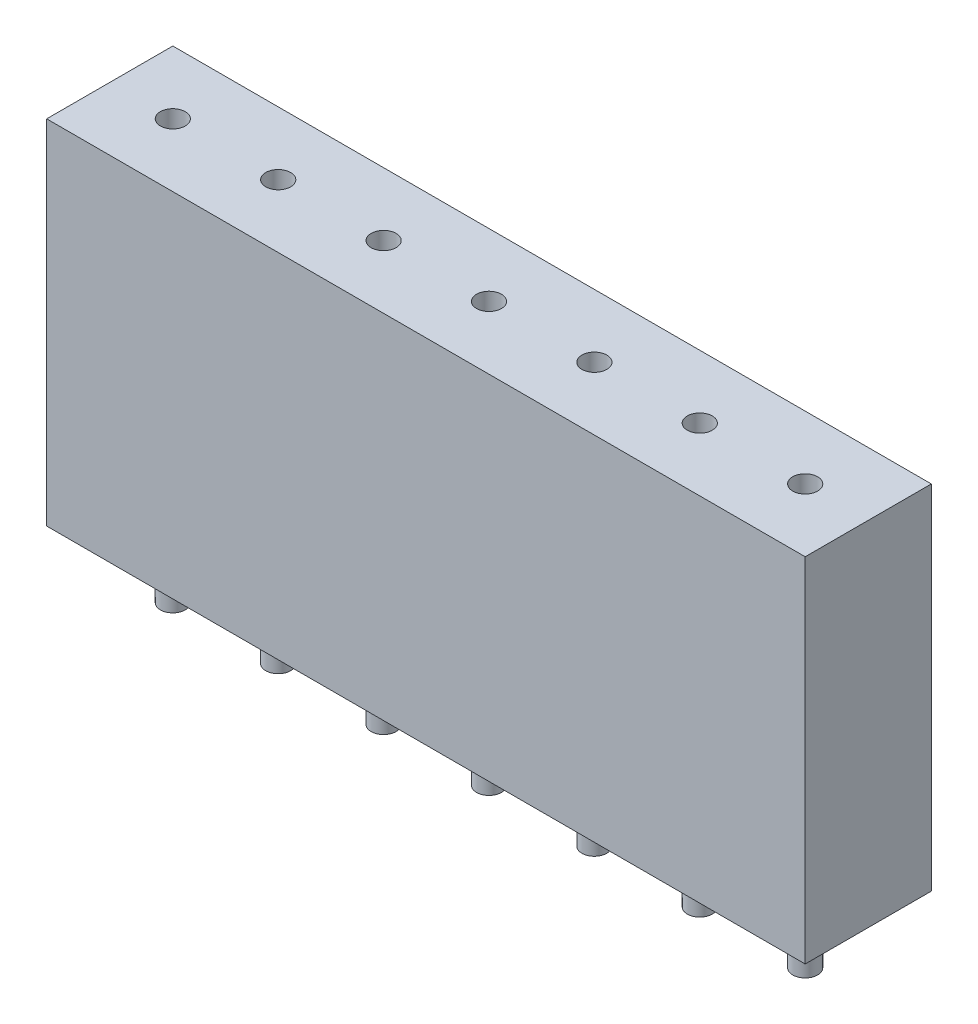
ISO-10303-21;
HEADER;
FILE_DESCRIPTION(('STEP AP214'),'2;1');
FILE_NAME('part.step','',(''),(''),'','','');
FILE_SCHEMA(('AUTOMOTIVE_DESIGN { 1 0 10303 214 1 1 1 1 }'));
ENDSEC;
DATA;
#1=APPLICATION_CONTEXT('core data for automotive mechanical design processes');
#2=APPLICATION_PROTOCOL_DEFINITION('international standard','automotive_design',2000,#1);
#3=PRODUCT_CONTEXT('',#1,'mechanical');
#4=PRODUCT('Part','Part','',(#3));
#5=PRODUCT_RELATED_PRODUCT_CATEGORY('part','',(#4));
#6=PRODUCT_DEFINITION_FORMATION('','',#4);
#7=PRODUCT_DEFINITION_CONTEXT('part definition',#1,'design');
#8=PRODUCT_DEFINITION('design','',#6,#7);
#9=PRODUCT_DEFINITION_SHAPE('','',#8);
#10=(LENGTH_UNIT() NAMED_UNIT(*) SI_UNIT(.MILLI.,.METRE.));
#11=(NAMED_UNIT(*) PLANE_ANGLE_UNIT() SI_UNIT($,.RADIAN.));
#12=(NAMED_UNIT(*) SI_UNIT($,.STERADIAN.) SOLID_ANGLE_UNIT());
#13=UNCERTAINTY_MEASURE_WITH_UNIT(LENGTH_MEASURE(1.E-05),#10,'distance_accuracy_value','');
#14=(GEOMETRIC_REPRESENTATION_CONTEXT(3) GLOBAL_UNCERTAINTY_ASSIGNED_CONTEXT((#13)) GLOBAL_UNIT_ASSIGNED_CONTEXT((#10,
#11,#12)) REPRESENTATION_CONTEXT('',''));
#15=CARTESIAN_POINT('',(0.,0.,0.));
#16=DIRECTION('',(0.,0.,1.));
#17=DIRECTION('',(1.,0.,0.));
#18=AXIS2_PLACEMENT_3D('',#15,#16,#17);
#19=CARTESIAN_POINT('',(7.61999999999998,-1.6,0.));
#20=DIRECTION('',(0.,1.,0.));
#21=DIRECTION('',(0.,0.,1.));
#22=AXIS2_PLACEMENT_3D('',#19,#20,#21);
#23=CYLINDRICAL_SURFACE('',#22,0.3);
#24=CARTESIAN_POINT('',(7.61999999999998,-1.6,0.));
#25=DIRECTION('',(0.,-1.,0.));
#26=DIRECTION('',(0.,0.,-1.));
#27=AXIS2_PLACEMENT_3D('',#24,#25,#26);
#28=CIRCLE('',#27,0.3);
#29=CARTESIAN_POINT('',(7.61999999999998,-1.6,-0.3));
#30=VERTEX_POINT('',#29);
#31=EDGE_CURVE('E11',#30,#30,#28,.T.);
#32=ORIENTED_EDGE('',*,*,#31,.F.);
#33=EDGE_LOOP('',(#32));
#34=FACE_BOUND('',#33,.T.);
#35=CARTESIAN_POINT('',(7.61999999999998,0.,0.));
#36=DIRECTION('',(0.,-1.,0.));
#37=DIRECTION('',(0.,0.,-1.));
#38=AXIS2_PLACEMENT_3D('',#35,#36,#37);
#39=CIRCLE('',#38,0.3);
#40=CARTESIAN_POINT('',(7.61999999999998,0.,-0.3));
#41=VERTEX_POINT('',#40);
#42=EDGE_CURVE('E45',#41,#41,#39,.T.);
#43=ORIENTED_EDGE('',*,*,#42,.T.);
#44=EDGE_LOOP('',(#43));
#45=FACE_BOUND('',#44,.T.);
#46=ADVANCED_FACE('F42',(#34,#45),#23,.T.);
#47=CARTESIAN_POINT('',(7.61999999999998,-1.6,0.));
#48=DIRECTION('',(0.,-1.,0.));
#49=DIRECTION('',(0.,0.,-1.));
#50=AXIS2_PLACEMENT_3D('',#47,#48,#49);
#51=PLANE('',#50);
#52=ORIENTED_EDGE('',*,*,#31,.T.);
#53=EDGE_LOOP('',(#52));
#54=FACE_BOUND('',#53,.T.);
#55=ADVANCED_FACE('F57',(#54),#51,.T.);
#56=CARTESIAN_POINT('',(7.61999999999998,0.,0.));
#57=DIRECTION('',(0.,-1.,0.));
#58=DIRECTION('',(0.,0.,-1.));
#59=AXIS2_PLACEMENT_3D('',#56,#57,#58);
#60=PLANE('',#59);
#61=ORIENTED_EDGE('',*,*,#42,.F.);
#62=EDGE_LOOP('',(#61));
#63=FACE_BOUND('',#62,.T.);
#64=ADVANCED_FACE('F55',(#63),#60,.F.);
#65=CLOSED_SHELL('',(#46,#55,#64));
#66=MANIFOLD_SOLID_BREP('B2',#65);
#67=CARTESIAN_POINT('',(5.07999999999998,-1.6,0.));
#68=DIRECTION('',(0.,1.,0.));
#69=DIRECTION('',(0.,0.,1.));
#70=AXIS2_PLACEMENT_3D('',#67,#68,#69);
#71=CYLINDRICAL_SURFACE('',#70,0.3);
#72=CARTESIAN_POINT('',(5.07999999999998,-1.6,0.));
#73=DIRECTION('',(0.,-1.,0.));
#74=DIRECTION('',(0.,0.,-1.));
#75=AXIS2_PLACEMENT_3D('',#72,#73,#74);
#76=CIRCLE('',#75,0.3);
#77=CARTESIAN_POINT('',(5.07999999999998,-1.6,-0.3));
#78=VERTEX_POINT('',#77);
#79=EDGE_CURVE('E41',#78,#78,#76,.T.);
#80=ORIENTED_EDGE('',*,*,#79,.F.);
#81=EDGE_LOOP('',(#80));
#82=FACE_BOUND('',#81,.T.);
#83=CARTESIAN_POINT('',(5.07999999999998,0.,0.));
#84=DIRECTION('',(0.,-1.,0.));
#85=DIRECTION('',(0.,0.,-1.));
#86=AXIS2_PLACEMENT_3D('',#83,#84,#85);
#87=CIRCLE('',#86,0.3);
#88=CARTESIAN_POINT('',(5.07999999999998,0.,-0.3));
#89=VERTEX_POINT('',#88);
#90=EDGE_CURVE('E94',#89,#89,#87,.T.);
#91=ORIENTED_EDGE('',*,*,#90,.T.);
#92=EDGE_LOOP('',(#91));
#93=FACE_BOUND('',#92,.T.);
#94=ADVANCED_FACE('F91',(#82,#93),#71,.T.);
#95=CARTESIAN_POINT('',(5.07999999999998,-1.6,0.));
#96=DIRECTION('',(0.,-1.,0.));
#97=DIRECTION('',(0.,0.,-1.));
#98=AXIS2_PLACEMENT_3D('',#95,#96,#97);
#99=PLANE('',#98);
#100=ORIENTED_EDGE('',*,*,#79,.T.);
#101=EDGE_LOOP('',(#100));
#102=FACE_BOUND('',#101,.T.);
#103=ADVANCED_FACE('F106',(#102),#99,.T.);
#104=CARTESIAN_POINT('',(5.07999999999998,0.,0.));
#105=DIRECTION('',(0.,-1.,0.));
#106=DIRECTION('',(0.,0.,-1.));
#107=AXIS2_PLACEMENT_3D('',#104,#105,#106);
#108=PLANE('',#107);
#109=ORIENTED_EDGE('',*,*,#90,.F.);
#110=EDGE_LOOP('',(#109));
#111=FACE_BOUND('',#110,.T.);
#112=ADVANCED_FACE('F104',(#111),#108,.F.);
#113=CLOSED_SHELL('',(#94,#103,#112));
#114=MANIFOLD_SOLID_BREP('B6',#113);
#115=CARTESIAN_POINT('',(2.53999999999998,-1.6,0.));
#116=DIRECTION('',(0.,1.,0.));
#117=DIRECTION('',(0.,0.,1.));
#118=AXIS2_PLACEMENT_3D('',#115,#116,#117);
#119=CYLINDRICAL_SURFACE('',#118,0.3);
#120=CARTESIAN_POINT('',(2.53999999999998,-1.6,0.));
#121=DIRECTION('',(0.,-1.,0.));
#122=DIRECTION('',(0.,0.,-1.));
#123=AXIS2_PLACEMENT_3D('',#120,#121,#122);
#124=CIRCLE('',#123,0.3);
#125=CARTESIAN_POINT('',(2.53999999999998,-1.6,-0.3));
#126=VERTEX_POINT('',#125);
#127=EDGE_CURVE('E90',#126,#126,#124,.T.);
#128=ORIENTED_EDGE('',*,*,#127,.F.);
#129=EDGE_LOOP('',(#128));
#130=FACE_BOUND('',#129,.T.);
#131=CARTESIAN_POINT('',(2.53999999999998,0.,0.));
#132=DIRECTION('',(0.,-1.,0.));
#133=DIRECTION('',(0.,0.,-1.));
#134=AXIS2_PLACEMENT_3D('',#131,#132,#133);
#135=CIRCLE('',#134,0.3);
#136=CARTESIAN_POINT('',(2.53999999999998,0.,-0.3));
#137=VERTEX_POINT('',#136);
#138=EDGE_CURVE('E143',#137,#137,#135,.T.);
#139=ORIENTED_EDGE('',*,*,#138,.T.);
#140=EDGE_LOOP('',(#139));
#141=FACE_BOUND('',#140,.T.);
#142=ADVANCED_FACE('F140',(#130,#141),#119,.T.);
#143=CARTESIAN_POINT('',(2.53999999999998,-1.6,0.));
#144=DIRECTION('',(0.,-1.,0.));
#145=DIRECTION('',(0.,0.,-1.));
#146=AXIS2_PLACEMENT_3D('',#143,#144,#145);
#147=PLANE('',#146);
#148=ORIENTED_EDGE('',*,*,#127,.T.);
#149=EDGE_LOOP('',(#148));
#150=FACE_BOUND('',#149,.T.);
#151=ADVANCED_FACE('F155',(#150),#147,.T.);
#152=CARTESIAN_POINT('',(2.53999999999998,0.,0.));
#153=DIRECTION('',(0.,-1.,0.));
#154=DIRECTION('',(0.,0.,-1.));
#155=AXIS2_PLACEMENT_3D('',#152,#153,#154);
#156=PLANE('',#155);
#157=ORIENTED_EDGE('',*,*,#138,.F.);
#158=EDGE_LOOP('',(#157));
#159=FACE_BOUND('',#158,.T.);
#160=ADVANCED_FACE('F153',(#159),#156,.F.);
#161=CLOSED_SHELL('',(#142,#151,#160));
#162=MANIFOLD_SOLID_BREP('B36',#161);
#163=CARTESIAN_POINT('',(0.,-1.6,0.));
#164=DIRECTION('',(0.,1.,0.));
#165=DIRECTION('',(0.,0.,1.));
#166=AXIS2_PLACEMENT_3D('',#163,#164,#165);
#167=CYLINDRICAL_SURFACE('',#166,0.3);
#168=CARTESIAN_POINT('',(0.,-1.6,0.));
#169=DIRECTION('',(0.,-1.,0.));
#170=DIRECTION('',(0.,0.,-1.));
#171=AXIS2_PLACEMENT_3D('',#168,#169,#170);
#172=CIRCLE('',#171,0.3);
#173=CARTESIAN_POINT('',(0.,-1.6,-0.3));
#174=VERTEX_POINT('',#173);
#175=EDGE_CURVE('E139',#174,#174,#172,.T.);
#176=ORIENTED_EDGE('',*,*,#175,.F.);
#177=EDGE_LOOP('',(#176));
#178=FACE_BOUND('',#177,.T.);
#179=CARTESIAN_POINT('',(0.,0.,0.));
#180=DIRECTION('',(0.,-1.,0.));
#181=DIRECTION('',(0.,0.,-1.));
#182=AXIS2_PLACEMENT_3D('',#179,#180,#181);
#183=CIRCLE('',#182,0.3);
#184=CARTESIAN_POINT('',(0.,0.,-0.3));
#185=VERTEX_POINT('',#184);
#186=EDGE_CURVE('E192',#185,#185,#183,.T.);
#187=ORIENTED_EDGE('',*,*,#186,.T.);
#188=EDGE_LOOP('',(#187));
#189=FACE_BOUND('',#188,.T.);
#190=ADVANCED_FACE('F189',(#178,#189),#167,.T.);
#191=CARTESIAN_POINT('',(0.,-1.6,0.));
#192=DIRECTION('',(0.,-1.,0.));
#193=DIRECTION('',(0.,0.,-1.));
#194=AXIS2_PLACEMENT_3D('',#191,#192,#193);
#195=PLANE('',#194);
#196=ORIENTED_EDGE('',*,*,#175,.T.);
#197=EDGE_LOOP('',(#196));
#198=FACE_BOUND('',#197,.T.);
#199=ADVANCED_FACE('F204',(#198),#195,.T.);
#200=CARTESIAN_POINT('',(0.,0.,0.));
#201=DIRECTION('',(0.,-1.,0.));
#202=DIRECTION('',(0.,0.,-1.));
#203=AXIS2_PLACEMENT_3D('',#200,#201,#202);
#204=PLANE('',#203);
#205=ORIENTED_EDGE('',*,*,#186,.F.);
#206=EDGE_LOOP('',(#205));
#207=FACE_BOUND('',#206,.T.);
#208=ADVANCED_FACE('F202',(#207),#204,.F.);
#209=CLOSED_SHELL('',(#190,#199,#208));
#210=MANIFOLD_SOLID_BREP('B85',#209);
#211=CARTESIAN_POINT('',(-2.54000000000002,-1.6,0.));
#212=DIRECTION('',(0.,1.,0.));
#213=DIRECTION('',(0.,0.,1.));
#214=AXIS2_PLACEMENT_3D('',#211,#212,#213);
#215=CYLINDRICAL_SURFACE('',#214,0.3);
#216=CARTESIAN_POINT('',(-2.54000000000002,-1.6,0.));
#217=DIRECTION('',(0.,-1.,0.));
#218=DIRECTION('',(0.,0.,-1.));
#219=AXIS2_PLACEMENT_3D('',#216,#217,#218);
#220=CIRCLE('',#219,0.3);
#221=CARTESIAN_POINT('',(-2.54000000000002,-1.6,-0.3));
#222=VERTEX_POINT('',#221);
#223=EDGE_CURVE('E188',#222,#222,#220,.T.);
#224=ORIENTED_EDGE('',*,*,#223,.F.);
#225=EDGE_LOOP('',(#224));
#226=FACE_BOUND('',#225,.T.);
#227=CARTESIAN_POINT('',(-2.54000000000002,0.,0.));
#228=DIRECTION('',(0.,-1.,0.));
#229=DIRECTION('',(0.,0.,-1.));
#230=AXIS2_PLACEMENT_3D('',#227,#228,#229);
#231=CIRCLE('',#230,0.3);
#232=CARTESIAN_POINT('',(-2.54000000000002,0.,-0.3));
#233=VERTEX_POINT('',#232);
#234=EDGE_CURVE('E241',#233,#233,#231,.T.);
#235=ORIENTED_EDGE('',*,*,#234,.T.);
#236=EDGE_LOOP('',(#235));
#237=FACE_BOUND('',#236,.T.);
#238=ADVANCED_FACE('F238',(#226,#237),#215,.T.);
#239=CARTESIAN_POINT('',(-2.54000000000002,-1.6,0.));
#240=DIRECTION('',(0.,-1.,0.));
#241=DIRECTION('',(0.,0.,-1.));
#242=AXIS2_PLACEMENT_3D('',#239,#240,#241);
#243=PLANE('',#242);
#244=ORIENTED_EDGE('',*,*,#223,.T.);
#245=EDGE_LOOP('',(#244));
#246=FACE_BOUND('',#245,.T.);
#247=ADVANCED_FACE('F253',(#246),#243,.T.);
#248=CARTESIAN_POINT('',(-2.54000000000002,0.,0.));
#249=DIRECTION('',(0.,-1.,0.));
#250=DIRECTION('',(0.,0.,-1.));
#251=AXIS2_PLACEMENT_3D('',#248,#249,#250);
#252=PLANE('',#251);
#253=ORIENTED_EDGE('',*,*,#234,.F.);
#254=EDGE_LOOP('',(#253));
#255=FACE_BOUND('',#254,.T.);
#256=ADVANCED_FACE('F251',(#255),#252,.F.);
#257=CLOSED_SHELL('',(#238,#247,#256));
#258=MANIFOLD_SOLID_BREP('B134',#257);
#259=CARTESIAN_POINT('',(-7.62000000000002,-1.6,0.));
#260=DIRECTION('',(0.,1.,0.));
#261=DIRECTION('',(0.,0.,1.));
#262=AXIS2_PLACEMENT_3D('',#259,#260,#261);
#263=CYLINDRICAL_SURFACE('',#262,0.3);
#264=CARTESIAN_POINT('',(-7.62000000000002,-1.6,0.));
#265=DIRECTION('',(0.,-1.,0.));
#266=DIRECTION('',(0.,0.,-1.));
#267=AXIS2_PLACEMENT_3D('',#264,#265,#266);
#268=CIRCLE('',#267,0.3);
#269=CARTESIAN_POINT('',(-7.62000000000002,-1.6,-0.3));
#270=VERTEX_POINT('',#269);
#271=EDGE_CURVE('E237',#270,#270,#268,.T.);
#272=ORIENTED_EDGE('',*,*,#271,.F.);
#273=EDGE_LOOP('',(#272));
#274=FACE_BOUND('',#273,.T.);
#275=CARTESIAN_POINT('',(-7.62000000000002,0.,0.));
#276=DIRECTION('',(0.,-1.,0.));
#277=DIRECTION('',(0.,0.,-1.));
#278=AXIS2_PLACEMENT_3D('',#275,#276,#277);
#279=CIRCLE('',#278,0.3);
#280=CARTESIAN_POINT('',(-7.62000000000002,0.,-0.3));
#281=VERTEX_POINT('',#280);
#282=EDGE_CURVE('E290',#281,#281,#279,.T.);
#283=ORIENTED_EDGE('',*,*,#282,.T.);
#284=EDGE_LOOP('',(#283));
#285=FACE_BOUND('',#284,.T.);
#286=ADVANCED_FACE('F287',(#274,#285),#263,.T.);
#287=CARTESIAN_POINT('',(-7.62000000000002,-1.6,0.));
#288=DIRECTION('',(0.,-1.,0.));
#289=DIRECTION('',(0.,0.,-1.));
#290=AXIS2_PLACEMENT_3D('',#287,#288,#289);
#291=PLANE('',#290);
#292=ORIENTED_EDGE('',*,*,#271,.T.);
#293=EDGE_LOOP('',(#292));
#294=FACE_BOUND('',#293,.T.);
#295=ADVANCED_FACE('F302',(#294),#291,.T.);
#296=CARTESIAN_POINT('',(-7.62000000000002,0.,0.));
#297=DIRECTION('',(0.,-1.,0.));
#298=DIRECTION('',(0.,0.,-1.));
#299=AXIS2_PLACEMENT_3D('',#296,#297,#298);
#300=PLANE('',#299);
#301=ORIENTED_EDGE('',*,*,#282,.F.);
#302=EDGE_LOOP('',(#301));
#303=FACE_BOUND('',#302,.T.);
#304=ADVANCED_FACE('F300',(#303),#300,.F.);
#305=CLOSED_SHELL('',(#286,#295,#304));
#306=MANIFOLD_SOLID_BREP('B183',#305);
#307=CARTESIAN_POINT('',(-5.08000000000002,-1.6,0.));
#308=DIRECTION('',(0.,1.,0.));
#309=DIRECTION('',(0.,0.,1.));
#310=AXIS2_PLACEMENT_3D('',#307,#308,#309);
#311=CYLINDRICAL_SURFACE('',#310,0.3);
#312=CARTESIAN_POINT('',(-5.08000000000002,-1.6,0.));
#313=DIRECTION('',(0.,-1.,0.));
#314=DIRECTION('',(0.,0.,-1.));
#315=AXIS2_PLACEMENT_3D('',#312,#313,#314);
#316=CIRCLE('',#315,0.3);
#317=CARTESIAN_POINT('',(-5.08000000000002,-1.6,-0.3));
#318=VERTEX_POINT('',#317);
#319=EDGE_CURVE('E286',#318,#318,#316,.T.);
#320=ORIENTED_EDGE('',*,*,#319,.F.);
#321=EDGE_LOOP('',(#320));
#322=FACE_BOUND('',#321,.T.);
#323=CARTESIAN_POINT('',(-5.08000000000002,0.,0.));
#324=DIRECTION('',(0.,-1.,0.));
#325=DIRECTION('',(0.,0.,-1.));
#326=AXIS2_PLACEMENT_3D('',#323,#324,#325);
#327=CIRCLE('',#326,0.3);
#328=CARTESIAN_POINT('',(-5.08000000000002,0.,-0.3));
#329=VERTEX_POINT('',#328);
#330=EDGE_CURVE('E340',#329,#329,#327,.T.);
#331=ORIENTED_EDGE('',*,*,#330,.T.);
#332=EDGE_LOOP('',(#331));
#333=FACE_BOUND('',#332,.T.);
#334=ADVANCED_FACE('F337',(#322,#333),#311,.T.);
#335=CARTESIAN_POINT('',(-5.08000000000002,-1.6,0.));
#336=DIRECTION('',(0.,-1.,0.));
#337=DIRECTION('',(0.,0.,-1.));
#338=AXIS2_PLACEMENT_3D('',#335,#336,#337);
#339=PLANE('',#338);
#340=ORIENTED_EDGE('',*,*,#319,.T.);
#341=EDGE_LOOP('',(#340));
#342=FACE_BOUND('',#341,.T.);
#343=ADVANCED_FACE('F352',(#342),#339,.T.);
#344=CARTESIAN_POINT('',(-5.08000000000002,0.,0.));
#345=DIRECTION('',(0.,-1.,0.));
#346=DIRECTION('',(0.,0.,-1.));
#347=AXIS2_PLACEMENT_3D('',#344,#345,#346);
#348=PLANE('',#347);
#349=ORIENTED_EDGE('',*,*,#330,.F.);
#350=EDGE_LOOP('',(#349));
#351=FACE_BOUND('',#350,.T.);
#352=ADVANCED_FACE('F350',(#351),#348,.F.);
#353=CLOSED_SHELL('',(#334,#343,#352));
#354=MANIFOLD_SOLID_BREP('B232',#353);
#355=CARTESIAN_POINT('',(9.14,8.5,-1.52));
#356=DIRECTION('',(-1.,0.,0.));
#357=DIRECTION('',(0.,0.,1.));
#358=AXIS2_PLACEMENT_3D('',#355,#356,#357);
#359=PLANE('',#358);
#360=DIRECTION('',(0.,0.,-1.));
#361=VECTOR('',#360,1.);
#362=CARTESIAN_POINT('',(9.14,0.,-1.52));
#363=LINE('',#362,#361);
#364=CARTESIAN_POINT('',(9.14,0.,1.52));
#365=VERTEX_POINT('',#364);
#366=CARTESIAN_POINT('',(9.14,0.,-1.52));
#367=VERTEX_POINT('',#366);
#368=EDGE_CURVE('E441',#365,#367,#363,.T.);
#369=ORIENTED_EDGE('',*,*,#368,.T.);
#370=DIRECTION('',(0.,-1.,0.));
#371=VECTOR('',#370,1.);
#372=CARTESIAN_POINT('',(9.14,8.5,-1.52));
#373=LINE('',#372,#371);
#374=CARTESIAN_POINT('',(9.14,8.5,-1.52));
#375=VERTEX_POINT('',#374);
#376=EDGE_CURVE('E335',#375,#367,#373,.T.);
#377=ORIENTED_EDGE('',*,*,#376,.F.);
#378=DIRECTION('',(0.,0.,-1.));
#379=VECTOR('',#378,1.);
#380=CARTESIAN_POINT('',(9.14,8.5,-1.52));
#381=LINE('',#380,#379);
#382=CARTESIAN_POINT('',(9.14,8.5,1.52));
#383=VERTEX_POINT('',#382);
#384=EDGE_CURVE('E429',#383,#375,#381,.T.);
#385=ORIENTED_EDGE('',*,*,#384,.F.);
#386=DIRECTION('',(0.,-1.,0.));
#387=VECTOR('',#386,1.);
#388=CARTESIAN_POINT('',(9.14,8.5,1.52));
#389=LINE('',#388,#387);
#390=EDGE_CURVE('E437',#383,#365,#389,.T.);
#391=ORIENTED_EDGE('',*,*,#390,.T.);
#392=EDGE_LOOP('',(#369,#377,#385,#391));
#393=FACE_BOUND('',#392,.T.);
#394=ADVANCED_FACE('F378',(#393),#359,.F.);
#395=CARTESIAN_POINT('',(-9.14,8.5,-1.52));
#396=DIRECTION('',(0.,0.,1.));
#397=DIRECTION('',(1.,0.,0.));
#398=AXIS2_PLACEMENT_3D('',#395,#396,#397);
#399=PLANE('',#398);
#400=DIRECTION('',(-1.,0.,0.));
#401=VECTOR('',#400,1.);
#402=CARTESIAN_POINT('',(-9.14,0.,-1.52));
#403=LINE('',#402,#401);
#404=CARTESIAN_POINT('',(-9.14,0.,-1.52));
#405=VERTEX_POINT('',#404);
#406=EDGE_CURVE('E433',#367,#405,#403,.T.);
#407=ORIENTED_EDGE('',*,*,#406,.T.);
#408=DIRECTION('',(0.,-1.,0.));
#409=VECTOR('',#408,1.);
#410=CARTESIAN_POINT('',(-9.14,8.5,-1.52));
#411=LINE('',#410,#409);
#412=CARTESIAN_POINT('',(-9.14,8.5,-1.52));
#413=VERTEX_POINT('',#412);
#414=EDGE_CURVE('E386',#413,#405,#411,.T.);
#415=ORIENTED_EDGE('',*,*,#414,.F.);
#416=DIRECTION('',(-1.,0.,0.));
#417=VECTOR('',#416,1.);
#418=CARTESIAN_POINT('',(-9.14,8.5,-1.52));
#419=LINE('',#418,#417);
#420=EDGE_CURVE('E424',#375,#413,#419,.T.);
#421=ORIENTED_EDGE('',*,*,#420,.F.);
#422=ORIENTED_EDGE('',*,*,#376,.T.);
#423=EDGE_LOOP('',(#407,#415,#421,#422));
#424=FACE_BOUND('',#423,.T.);
#425=ADVANCED_FACE('F432',(#424),#399,.F.);
#426=CARTESIAN_POINT('',(-9.14,8.5,-1.52));
#427=DIRECTION('',(1.,0.,0.));
#428=DIRECTION('',(0.,0.,-1.));
#429=AXIS2_PLACEMENT_3D('',#426,#427,#428);
#430=PLANE('',#429);
#431=DIRECTION('',(0.,0.,1.));
#432=VECTOR('',#431,1.);
#433=CARTESIAN_POINT('',(-9.14,0.,-1.52));
#434=LINE('',#433,#432);
#435=CARTESIAN_POINT('',(-9.14,0.,1.52));
#436=VERTEX_POINT('',#435);
#437=EDGE_CURVE('E411',#405,#436,#434,.T.);
#438=ORIENTED_EDGE('',*,*,#437,.T.);
#439=DIRECTION('',(0.,-1.,0.));
#440=VECTOR('',#439,1.);
#441=CARTESIAN_POINT('',(-9.14,8.5,1.52));
#442=LINE('',#441,#440);
#443=CARTESIAN_POINT('',(-9.14,8.5,1.52));
#444=VERTEX_POINT('',#443);
#445=EDGE_CURVE('E434',#444,#436,#442,.T.);
#446=ORIENTED_EDGE('',*,*,#445,.F.);
#447=DIRECTION('',(0.,0.,1.));
#448=VECTOR('',#447,1.);
#449=CARTESIAN_POINT('',(-9.14,8.5,-1.52));
#450=LINE('',#449,#448);
#451=EDGE_CURVE('E427',#413,#444,#450,.T.);
#452=ORIENTED_EDGE('',*,*,#451,.F.);
#453=ORIENTED_EDGE('',*,*,#414,.T.);
#454=EDGE_LOOP('',(#438,#446,#452,#453));
#455=FACE_BOUND('',#454,.T.);
#456=ADVANCED_FACE('F435',(#455),#430,.F.);
#457=CARTESIAN_POINT('',(-9.14,8.5,1.52));
#458=DIRECTION('',(0.,0.,-1.));
#459=DIRECTION('',(-1.,0.,0.));
#460=AXIS2_PLACEMENT_3D('',#457,#458,#459);
#461=PLANE('',#460);
#462=DIRECTION('',(1.,0.,0.));
#463=VECTOR('',#462,1.);
#464=CARTESIAN_POINT('',(-9.14,0.,1.52));
#465=LINE('',#464,#463);
#466=EDGE_CURVE('E417',#436,#365,#465,.T.);
#467=ORIENTED_EDGE('',*,*,#466,.T.);
#468=ORIENTED_EDGE('',*,*,#390,.F.);
#469=DIRECTION('',(1.,0.,0.));
#470=VECTOR('',#469,1.);
#471=CARTESIAN_POINT('',(-9.14,8.5,1.52));
#472=LINE('',#471,#470);
#473=EDGE_CURVE('E394',#444,#383,#472,.T.);
#474=ORIENTED_EDGE('',*,*,#473,.F.);
#475=ORIENTED_EDGE('',*,*,#445,.T.);
#476=EDGE_LOOP('',(#467,#468,#474,#475));
#477=FACE_BOUND('',#476,.T.);
#478=ADVANCED_FACE('F449',(#477),#461,.F.);
#479=CARTESIAN_POINT('',(0.,8.5,0.));
#480=DIRECTION('',(0.,1.,0.));
#481=DIRECTION('',(0.,0.,1.));
#482=AXIS2_PLACEMENT_3D('',#479,#480,#481);
#483=PLANE('',#482);
#484=CARTESIAN_POINT('',(7.61999999999998,8.5,0.));
#485=DIRECTION('',(0.,1.,0.));
#486=DIRECTION('',(0.,0.,1.));
#487=AXIS2_PLACEMENT_3D('',#484,#485,#486);
#488=CIRCLE('',#487,0.3);
#489=CARTESIAN_POINT('',(7.61999999999998,8.5,0.3));
#490=VERTEX_POINT('',#489);
#491=EDGE_CURVE('E491',#490,#490,#488,.T.);
#492=ORIENTED_EDGE('',*,*,#491,.F.);
#493=EDGE_LOOP('',(#492));
#494=FACE_BOUND('',#493,.T.);
#495=CARTESIAN_POINT('',(5.07999999999998,8.5,0.));
#496=DIRECTION('',(0.,1.,0.));
#497=DIRECTION('',(0.,0.,1.));
#498=AXIS2_PLACEMENT_3D('',#495,#496,#497);
#499=CIRCLE('',#498,0.3);
#500=CARTESIAN_POINT('',(5.07999999999998,8.5,0.3));
#501=VERTEX_POINT('',#500);
#502=EDGE_CURVE('E485',#501,#501,#499,.T.);
#503=ORIENTED_EDGE('',*,*,#502,.F.);
#504=EDGE_LOOP('',(#503));
#505=FACE_BOUND('',#504,.T.);
#506=CARTESIAN_POINT('',(2.53999999999998,8.5,0.));
#507=DIRECTION('',(0.,1.,0.));
#508=DIRECTION('',(0.,0.,1.));
#509=AXIS2_PLACEMENT_3D('',#506,#507,#508);
#510=CIRCLE('',#509,0.3);
#511=CARTESIAN_POINT('',(2.53999999999998,8.5,0.3));
#512=VERTEX_POINT('',#511);
#513=EDGE_CURVE('E479',#512,#512,#510,.T.);
#514=ORIENTED_EDGE('',*,*,#513,.F.);
#515=EDGE_LOOP('',(#514));
#516=FACE_BOUND('',#515,.T.);
#517=CARTESIAN_POINT('',(0.,8.5,0.));
#518=DIRECTION('',(0.,1.,0.));
#519=DIRECTION('',(0.,0.,1.));
#520=AXIS2_PLACEMENT_3D('',#517,#518,#519);
#521=CIRCLE('',#520,0.3);
#522=CARTESIAN_POINT('',(0.,8.5,0.3));
#523=VERTEX_POINT('',#522);
#524=EDGE_CURVE('E473',#523,#523,#521,.T.);
#525=ORIENTED_EDGE('',*,*,#524,.F.);
#526=EDGE_LOOP('',(#525));
#527=FACE_BOUND('',#526,.T.);
#528=CARTESIAN_POINT('',(-2.54000000000002,8.5,0.));
#529=DIRECTION('',(0.,1.,0.));
#530=DIRECTION('',(0.,0.,1.));
#531=AXIS2_PLACEMENT_3D('',#528,#529,#530);
#532=CIRCLE('',#531,0.3);
#533=CARTESIAN_POINT('',(-2.54000000000002,8.5,0.3));
#534=VERTEX_POINT('',#533);
#535=EDGE_CURVE('E467',#534,#534,#532,.T.);
#536=ORIENTED_EDGE('',*,*,#535,.F.);
#537=EDGE_LOOP('',(#536));
#538=FACE_BOUND('',#537,.T.);
#539=CARTESIAN_POINT('',(-7.62000000000002,8.5,0.));
#540=DIRECTION('',(0.,1.,0.));
#541=DIRECTION('',(0.,0.,1.));
#542=AXIS2_PLACEMENT_3D('',#539,#540,#541);
#543=CIRCLE('',#542,0.3);
#544=CARTESIAN_POINT('',(-7.62000000000002,8.5,0.3));
#545=VERTEX_POINT('',#544);
#546=EDGE_CURVE('E461',#545,#545,#543,.T.);
#547=ORIENTED_EDGE('',*,*,#546,.F.);
#548=EDGE_LOOP('',(#547));
#549=FACE_BOUND('',#548,.T.);
#550=CARTESIAN_POINT('',(-5.08000000000002,8.5,0.));
#551=DIRECTION('',(0.,1.,0.));
#552=DIRECTION('',(0.,0.,1.));
#553=AXIS2_PLACEMENT_3D('',#550,#551,#552);
#554=CIRCLE('',#553,0.3);
#555=CARTESIAN_POINT('',(-5.08000000000002,8.5,0.3));
#556=VERTEX_POINT('',#555);
#557=EDGE_CURVE('E455',#556,#556,#554,.T.);
#558=ORIENTED_EDGE('',*,*,#557,.F.);
#559=EDGE_LOOP('',(#558));
#560=FACE_BOUND('',#559,.T.);
#561=ORIENTED_EDGE('',*,*,#384,.T.);
#562=ORIENTED_EDGE('',*,*,#420,.T.);
#563=ORIENTED_EDGE('',*,*,#451,.T.);
#564=ORIENTED_EDGE('',*,*,#473,.T.);
#565=EDGE_LOOP('',(#561,#562,#563,#564));
#566=FACE_BOUND('',#565,.T.);
#567=ADVANCED_FACE('F425',(#494,#505,#516,#527,#538,#549,#560,#566),#483,.T.);
#568=CARTESIAN_POINT('',(0.,0.,0.));
#569=DIRECTION('',(0.,1.,0.));
#570=DIRECTION('',(0.,0.,1.));
#571=AXIS2_PLACEMENT_3D('',#568,#569,#570);
#572=PLANE('',#571);
#573=CARTESIAN_POINT('',(7.61999999999998,0.,0.));
#574=DIRECTION('',(0.,1.,0.));
#575=DIRECTION('',(0.,0.,1.));
#576=AXIS2_PLACEMENT_3D('',#573,#574,#575);
#577=CIRCLE('',#576,0.3);
#578=CARTESIAN_POINT('',(7.61999999999998,0.,0.3));
#579=VERTEX_POINT('',#578);
#580=EDGE_CURVE('E488',#579,#579,#577,.T.);
#581=ORIENTED_EDGE('',*,*,#580,.T.);
#582=EDGE_LOOP('',(#581));
#583=FACE_BOUND('',#582,.T.);
#584=CARTESIAN_POINT('',(5.07999999999998,0.,0.));
#585=DIRECTION('',(0.,1.,0.));
#586=DIRECTION('',(0.,0.,1.));
#587=AXIS2_PLACEMENT_3D('',#584,#585,#586);
#588=CIRCLE('',#587,0.3);
#589=CARTESIAN_POINT('',(5.07999999999998,0.,0.3));
#590=VERTEX_POINT('',#589);
#591=EDGE_CURVE('E482',#590,#590,#588,.T.);
#592=ORIENTED_EDGE('',*,*,#591,.T.);
#593=EDGE_LOOP('',(#592));
#594=FACE_BOUND('',#593,.T.);
#595=CARTESIAN_POINT('',(2.53999999999998,0.,0.));
#596=DIRECTION('',(0.,1.,0.));
#597=DIRECTION('',(0.,0.,1.));
#598=AXIS2_PLACEMENT_3D('',#595,#596,#597);
#599=CIRCLE('',#598,0.3);
#600=CARTESIAN_POINT('',(2.53999999999998,0.,0.3));
#601=VERTEX_POINT('',#600);
#602=EDGE_CURVE('E476',#601,#601,#599,.T.);
#603=ORIENTED_EDGE('',*,*,#602,.T.);
#604=EDGE_LOOP('',(#603));
#605=FACE_BOUND('',#604,.T.);
#606=CARTESIAN_POINT('',(0.,0.,0.));
#607=DIRECTION('',(0.,1.,0.));
#608=DIRECTION('',(0.,0.,1.));
#609=AXIS2_PLACEMENT_3D('',#606,#607,#608);
#610=CIRCLE('',#609,0.3);
#611=CARTESIAN_POINT('',(0.,0.,0.3));
#612=VERTEX_POINT('',#611);
#613=EDGE_CURVE('E470',#612,#612,#610,.T.);
#614=ORIENTED_EDGE('',*,*,#613,.T.);
#615=EDGE_LOOP('',(#614));
#616=FACE_BOUND('',#615,.T.);
#617=CARTESIAN_POINT('',(-2.54000000000002,0.,0.));
#618=DIRECTION('',(0.,1.,0.));
#619=DIRECTION('',(0.,0.,1.));
#620=AXIS2_PLACEMENT_3D('',#617,#618,#619);
#621=CIRCLE('',#620,0.3);
#622=CARTESIAN_POINT('',(-2.54000000000002,0.,0.3));
#623=VERTEX_POINT('',#622);
#624=EDGE_CURVE('E464',#623,#623,#621,.T.);
#625=ORIENTED_EDGE('',*,*,#624,.T.);
#626=EDGE_LOOP('',(#625));
#627=FACE_BOUND('',#626,.T.);
#628=CARTESIAN_POINT('',(-7.62000000000002,0.,0.));
#629=DIRECTION('',(0.,1.,0.));
#630=DIRECTION('',(0.,0.,1.));
#631=AXIS2_PLACEMENT_3D('',#628,#629,#630);
#632=CIRCLE('',#631,0.3);
#633=CARTESIAN_POINT('',(-7.62000000000002,0.,0.3));
#634=VERTEX_POINT('',#633);
#635=EDGE_CURVE('E458',#634,#634,#632,.T.);
#636=ORIENTED_EDGE('',*,*,#635,.T.);
#637=EDGE_LOOP('',(#636));
#638=FACE_BOUND('',#637,.T.);
#639=CARTESIAN_POINT('',(-5.08000000000002,0.,0.));
#640=DIRECTION('',(0.,1.,0.));
#641=DIRECTION('',(0.,0.,1.));
#642=AXIS2_PLACEMENT_3D('',#639,#640,#641);
#643=CIRCLE('',#642,0.3);
#644=CARTESIAN_POINT('',(-5.08000000000002,0.,0.3));
#645=VERTEX_POINT('',#644);
#646=EDGE_CURVE('E444',#645,#645,#643,.T.);
#647=ORIENTED_EDGE('',*,*,#646,.T.);
#648=EDGE_LOOP('',(#647));
#649=FACE_BOUND('',#648,.T.);
#650=ORIENTED_EDGE('',*,*,#368,.F.);
#651=ORIENTED_EDGE('',*,*,#466,.F.);
#652=ORIENTED_EDGE('',*,*,#437,.F.);
#653=ORIENTED_EDGE('',*,*,#406,.F.);
#654=EDGE_LOOP('',(#650,#651,#652,#653));
#655=FACE_BOUND('',#654,.T.);
#656=ADVANCED_FACE('F452',(#583,#594,#605,#616,#627,#638,#649,#655),#572,.F.);
#657=CARTESIAN_POINT('',(-5.08000000000002,0.,0.));
#658=DIRECTION('',(0.,1.,0.));
#659=DIRECTION('',(0.,0.,1.));
#660=AXIS2_PLACEMENT_3D('',#657,#658,#659);
#661=CYLINDRICAL_SURFACE('',#660,0.3);
#662=ORIENTED_EDGE('',*,*,#646,.F.);
#663=EDGE_LOOP('',(#662));
#664=FACE_BOUND('',#663,.T.);
#665=ORIENTED_EDGE('',*,*,#557,.T.);
#666=EDGE_LOOP('',(#665));
#667=FACE_BOUND('',#666,.T.);
#668=ADVANCED_FACE('F521',(#664,#667),#661,.F.);
#669=CARTESIAN_POINT('',(-7.62000000000002,0.,0.));
#670=DIRECTION('',(0.,1.,0.));
#671=DIRECTION('',(0.,0.,1.));
#672=AXIS2_PLACEMENT_3D('',#669,#670,#671);
#673=CYLINDRICAL_SURFACE('',#672,0.3);
#674=ORIENTED_EDGE('',*,*,#635,.F.);
#675=EDGE_LOOP('',(#674));
#676=FACE_BOUND('',#675,.T.);
#677=ORIENTED_EDGE('',*,*,#546,.T.);
#678=EDGE_LOOP('',(#677));
#679=FACE_BOUND('',#678,.T.);
#680=ADVANCED_FACE('F523',(#676,#679),#673,.F.);
#681=CARTESIAN_POINT('',(-2.54000000000002,0.,0.));
#682=DIRECTION('',(0.,1.,0.));
#683=DIRECTION('',(0.,0.,1.));
#684=AXIS2_PLACEMENT_3D('',#681,#682,#683);
#685=CYLINDRICAL_SURFACE('',#684,0.3);
#686=ORIENTED_EDGE('',*,*,#624,.F.);
#687=EDGE_LOOP('',(#686));
#688=FACE_BOUND('',#687,.T.);
#689=ORIENTED_EDGE('',*,*,#535,.T.);
#690=EDGE_LOOP('',(#689));
#691=FACE_BOUND('',#690,.T.);
#692=ADVANCED_FACE('F530',(#688,#691),#685,.F.);
#693=CARTESIAN_POINT('',(0.,0.,0.));
#694=DIRECTION('',(0.,1.,0.));
#695=DIRECTION('',(0.,0.,1.));
#696=AXIS2_PLACEMENT_3D('',#693,#694,#695);
#697=CYLINDRICAL_SURFACE('',#696,0.3);
#698=ORIENTED_EDGE('',*,*,#613,.F.);
#699=EDGE_LOOP('',(#698));
#700=FACE_BOUND('',#699,.T.);
#701=ORIENTED_EDGE('',*,*,#524,.T.);
#702=EDGE_LOOP('',(#701));
#703=FACE_BOUND('',#702,.T.);
#704=ADVANCED_FACE('F576',(#700,#703),#697,.F.);
#705=CARTESIAN_POINT('',(2.53999999999998,0.,0.));
#706=DIRECTION('',(0.,1.,0.));
#707=DIRECTION('',(0.,0.,1.));
#708=AXIS2_PLACEMENT_3D('',#705,#706,#707);
#709=CYLINDRICAL_SURFACE('',#708,0.3);
#710=ORIENTED_EDGE('',*,*,#602,.F.);
#711=EDGE_LOOP('',(#710));
#712=FACE_BOUND('',#711,.T.);
#713=ORIENTED_EDGE('',*,*,#513,.T.);
#714=EDGE_LOOP('',(#713));
#715=FACE_BOUND('',#714,.T.);
#716=ADVANCED_FACE('F586',(#712,#715),#709,.F.);
#717=CARTESIAN_POINT('',(5.07999999999998,0.,0.));
#718=DIRECTION('',(0.,1.,0.));
#719=DIRECTION('',(0.,0.,1.));
#720=AXIS2_PLACEMENT_3D('',#717,#718,#719);
#721=CYLINDRICAL_SURFACE('',#720,0.3);
#722=ORIENTED_EDGE('',*,*,#591,.F.);
#723=EDGE_LOOP('',(#722));
#724=FACE_BOUND('',#723,.T.);
#725=ORIENTED_EDGE('',*,*,#502,.T.);
#726=EDGE_LOOP('',(#725));
#727=FACE_BOUND('',#726,.T.);
#728=ADVANCED_FACE('F502',(#724,#727),#721,.F.);
#729=CARTESIAN_POINT('',(7.61999999999998,0.,0.));
#730=DIRECTION('',(0.,1.,0.));
#731=DIRECTION('',(0.,0.,1.));
#732=AXIS2_PLACEMENT_3D('',#729,#730,#731);
#733=CYLINDRICAL_SURFACE('',#732,0.3);
#734=ORIENTED_EDGE('',*,*,#580,.F.);
#735=EDGE_LOOP('',(#734));
#736=FACE_BOUND('',#735,.T.);
#737=ORIENTED_EDGE('',*,*,#491,.T.);
#738=EDGE_LOOP('',(#737));
#739=FACE_BOUND('',#738,.T.);
#740=ADVANCED_FACE('F499',(#736,#739),#733,.F.);
#741=CLOSED_SHELL('',(#394,#425,#456,#478,#567,#656,#668,#680,#692,#704,#716,#728,#740));
#742=MANIFOLD_SOLID_BREP('B281',#741);
#743=ADVANCED_BREP_SHAPE_REPRESENTATION('',(#18,#66,#114,#162,#210,#258,#306,#354,#742),#14);
#744=SHAPE_DEFINITION_REPRESENTATION(#9,#743);
ENDSEC;
END-ISO-10303-21;
